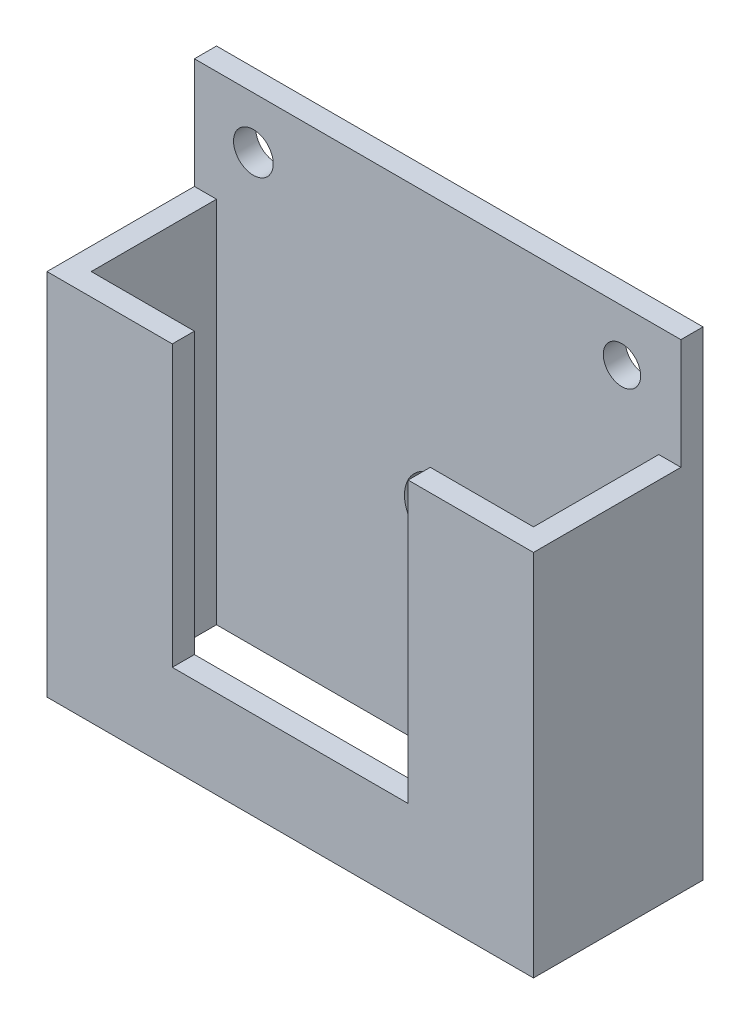
ISO-10303-21;
HEADER;
FILE_DESCRIPTION(('STEP AP214'),'2;1');
FILE_NAME('part.step','',(''),(''),'','','');
FILE_SCHEMA(('AUTOMOTIVE_DESIGN { 1 0 10303 214 1 1 1 1 }'));
ENDSEC;
DATA;
#1=APPLICATION_CONTEXT('core data for automotive mechanical design processes');
#2=APPLICATION_PROTOCOL_DEFINITION('international standard','automotive_design',2000,#1);
#3=PRODUCT_CONTEXT('',#1,'mechanical');
#4=PRODUCT('Part','Part','',(#3));
#5=PRODUCT_RELATED_PRODUCT_CATEGORY('part','',(#4));
#6=PRODUCT_DEFINITION_FORMATION('','',#4);
#7=PRODUCT_DEFINITION_CONTEXT('part definition',#1,'design');
#8=PRODUCT_DEFINITION('design','',#6,#7);
#9=PRODUCT_DEFINITION_SHAPE('','',#8);
#10=(LENGTH_UNIT() NAMED_UNIT(*) SI_UNIT(.MILLI.,.METRE.));
#11=(NAMED_UNIT(*) PLANE_ANGLE_UNIT() SI_UNIT($,.RADIAN.));
#12=(NAMED_UNIT(*) SI_UNIT($,.STERADIAN.) SOLID_ANGLE_UNIT());
#13=UNCERTAINTY_MEASURE_WITH_UNIT(LENGTH_MEASURE(1.E-05),#10,'distance_accuracy_value','');
#14=(GEOMETRIC_REPRESENTATION_CONTEXT(3) GLOBAL_UNCERTAINTY_ASSIGNED_CONTEXT((#13)) GLOBAL_UNIT_ASSIGNED_CONTEXT((#10,
#11,#12)) REPRESENTATION_CONTEXT('',''));
#15=CARTESIAN_POINT('',(0.,0.,0.));
#16=DIRECTION('',(0.,0.,1.));
#17=DIRECTION('',(1.,0.,0.));
#18=AXIS2_PLACEMENT_3D('',#15,#16,#17);
#19=CARTESIAN_POINT('',(-66.,0.,23.));
#20=DIRECTION('',(0.,1.,0.));
#21=DIRECTION('',(0.,0.,1.));
#22=AXIS2_PLACEMENT_3D('',#19,#20,#21);
#23=PLANE('',#22);
#24=DIRECTION('',(0.,0.,1.));
#25=VECTOR('',#24,1.);
#26=CARTESIAN_POINT('',(-66.,0.,23.));
#27=LINE('',#26,#25);
#28=CARTESIAN_POINT('',(-66.,0.,0.));
#29=VERTEX_POINT('',#28);
#30=CARTESIAN_POINT('',(-66.,0.,3.));
#31=VERTEX_POINT('',#30);
#32=EDGE_CURVE('E155',#29,#31,#27,.T.);
#33=ORIENTED_EDGE('',*,*,#32,.T.);
#34=DIRECTION('',(-1.,0.,0.));
#35=VECTOR('',#34,1.);
#36=CARTESIAN_POINT('',(-63.,0.,3.));
#37=LINE('',#36,#35);
#38=CARTESIAN_POINT('',(0.,0.,3.));
#39=VERTEX_POINT('',#38);
#40=EDGE_CURVE('E222',#39,#31,#37,.T.);
#41=ORIENTED_EDGE('',*,*,#40,.F.);
#42=DIRECTION('',(0.,0.,1.));
#43=VECTOR('',#42,1.);
#44=CARTESIAN_POINT('',(0.,0.,23.));
#45=LINE('',#44,#43);
#46=CARTESIAN_POINT('',(0.,0.,0.));
#47=VERTEX_POINT('',#46);
#48=EDGE_CURVE('E167',#47,#39,#45,.T.);
#49=ORIENTED_EDGE('',*,*,#48,.F.);
#50=DIRECTION('',(1.,0.,0.));
#51=VECTOR('',#50,1.);
#52=CARTESIAN_POINT('',(-66.,0.,0.));
#53=LINE('',#52,#51);
#54=EDGE_CURVE('E178',#29,#47,#53,.T.);
#55=ORIENTED_EDGE('',*,*,#54,.F.);
#56=EDGE_LOOP('',(#33,#41,#49,#55));
#57=FACE_BOUND('',#56,.T.);
#58=ADVANCED_FACE('F33',(#57),#23,.T.);
#59=CARTESIAN_POINT('',(-66.,0.,0.));
#60=DIRECTION('',(0.,0.,-1.));
#61=DIRECTION('',(-1.,0.,0.));
#62=AXIS2_PLACEMENT_3D('',#59,#60,#61);
#63=PLANE('',#62);
#64=CARTESIAN_POINT('',(-33.,-37.,0.));
#65=DIRECTION('',(0.,0.,-1.));
#66=DIRECTION('',(-1.,0.,0.));
#67=AXIS2_PLACEMENT_3D('',#64,#65,#66);
#68=CIRCLE('',#67,4.50000000000001);
#69=CARTESIAN_POINT('',(-37.5,-37.,0.));
#70=VERTEX_POINT('',#69);
#71=EDGE_CURVE('E205',#70,#70,#68,.T.);
#72=ORIENTED_EDGE('',*,*,#71,.F.);
#73=EDGE_LOOP('',(#72));
#74=FACE_BOUND('',#73,.T.);
#75=CARTESIAN_POINT('',(-8.,-7.00000000000001,0.));
#76=DIRECTION('',(0.,0.,-1.));
#77=DIRECTION('',(-1.,0.,0.));
#78=AXIS2_PLACEMENT_3D('',#75,#76,#77);
#79=CIRCLE('',#78,2.5305862175137);
#80=CARTESIAN_POINT('',(-10.5305862175137,-7.00000000000001,0.));
#81=VERTEX_POINT('',#80);
#82=EDGE_CURVE('E268',#81,#81,#79,.T.);
#83=ORIENTED_EDGE('',*,*,#82,.F.);
#84=EDGE_LOOP('',(#83));
#85=FACE_BOUND('',#84,.T.);
#86=CARTESIAN_POINT('',(-58.,-7.,0.));
#87=DIRECTION('',(0.,0.,-1.));
#88=DIRECTION('',(-1.,0.,0.));
#89=AXIS2_PLACEMENT_3D('',#86,#87,#88);
#90=CIRCLE('',#89,2.69284221962874);
#91=CARTESIAN_POINT('',(-60.6928422196287,-7.,0.));
#92=VERTEX_POINT('',#91);
#93=EDGE_CURVE('E208',#92,#92,#90,.T.);
#94=ORIENTED_EDGE('',*,*,#93,.F.);
#95=EDGE_LOOP('',(#94));
#96=FACE_BOUND('',#95,.T.);
#97=DIRECTION('',(0.,1.,0.));
#98=VECTOR('',#97,1.);
#99=CARTESIAN_POINT('',(0.,0.,0.));
#100=LINE('',#99,#98);
#101=CARTESIAN_POINT('',(0.,-65.,0.));
#102=VERTEX_POINT('',#101);
#103=EDGE_CURVE('E160',#102,#47,#100,.T.);
#104=ORIENTED_EDGE('',*,*,#103,.F.);
#105=DIRECTION('',(1.,0.,0.));
#106=VECTOR('',#105,1.);
#107=CARTESIAN_POINT('',(-66.,-65.,0.));
#108=LINE('',#107,#106);
#109=CARTESIAN_POINT('',(-66.,-65.,0.));
#110=VERTEX_POINT('',#109);
#111=EDGE_CURVE('E180',#110,#102,#108,.T.);
#112=ORIENTED_EDGE('',*,*,#111,.F.);
#113=DIRECTION('',(0.,1.,0.));
#114=VECTOR('',#113,1.);
#115=CARTESIAN_POINT('',(-66.,0.,0.));
#116=LINE('',#115,#114);
#117=EDGE_CURVE('E157',#110,#29,#116,.T.);
#118=ORIENTED_EDGE('',*,*,#117,.T.);
#119=ORIENTED_EDGE('',*,*,#54,.T.);
#120=EDGE_LOOP('',(#104,#112,#118,#119));
#121=FACE_BOUND('',#120,.T.);
#122=ADVANCED_FACE('F282',(#74,#85,#96,#121),#63,.T.);
#123=CARTESIAN_POINT('',(-66.,-65.,0.));
#124=DIRECTION('',(0.,-1.,0.));
#125=DIRECTION('',(0.,0.,-1.));
#126=AXIS2_PLACEMENT_3D('',#123,#124,#125);
#127=PLANE('',#126);
#128=DIRECTION('',(0.,0.,-1.));
#129=VECTOR('',#128,1.);
#130=CARTESIAN_POINT('',(-3.,-65.,20.));
#131=LINE('',#130,#129);
#132=CARTESIAN_POINT('',(-3.,-65.,20.));
#133=VERTEX_POINT('',#132);
#134=CARTESIAN_POINT('',(-3.,-65.,3.));
#135=VERTEX_POINT('',#134);
#136=EDGE_CURVE('E223',#133,#135,#131,.T.);
#137=ORIENTED_EDGE('',*,*,#136,.T.);
#138=DIRECTION('',(-1.,0.,0.));
#139=VECTOR('',#138,1.);
#140=CARTESIAN_POINT('',(-63.,-65.,3.));
#141=LINE('',#140,#139);
#142=CARTESIAN_POINT('',(-63.,-65.,3.));
#143=VERTEX_POINT('',#142);
#144=EDGE_CURVE('E226',#135,#143,#141,.T.);
#145=ORIENTED_EDGE('',*,*,#144,.T.);
#146=DIRECTION('',(0.,0.,1.));
#147=VECTOR('',#146,1.);
#148=CARTESIAN_POINT('',(-63.,-65.,20.));
#149=LINE('',#148,#147);
#150=CARTESIAN_POINT('',(-63.,-65.,20.));
#151=VERTEX_POINT('',#150);
#152=EDGE_CURVE('E229',#143,#151,#149,.T.);
#153=ORIENTED_EDGE('',*,*,#152,.T.);
#154=DIRECTION('',(1.,0.,0.));
#155=VECTOR('',#154,1.);
#156=CARTESIAN_POINT('',(-63.,-65.,20.));
#157=LINE('',#156,#155);
#158=EDGE_CURVE('E232',#151,#133,#157,.T.);
#159=ORIENTED_EDGE('',*,*,#158,.T.);
#160=EDGE_LOOP('',(#137,#145,#153,#159));
#161=FACE_BOUND('',#160,.T.);
#162=DIRECTION('',(0.,0.,-1.));
#163=VECTOR('',#162,1.);
#164=CARTESIAN_POINT('',(0.,-65.,0.));
#165=LINE('',#164,#163);
#166=CARTESIAN_POINT('',(0.,-65.,23.));
#167=VERTEX_POINT('',#166);
#168=EDGE_CURVE('E173',#167,#102,#165,.T.);
#169=ORIENTED_EDGE('',*,*,#168,.F.);
#170=DIRECTION('',(1.,0.,0.));
#171=VECTOR('',#170,1.);
#172=CARTESIAN_POINT('',(-66.,-65.,23.));
#173=LINE('',#172,#171);
#174=CARTESIAN_POINT('',(-66.,-65.,23.));
#175=VERTEX_POINT('',#174);
#176=EDGE_CURVE('E166',#175,#167,#173,.T.);
#177=ORIENTED_EDGE('',*,*,#176,.F.);
#178=DIRECTION('',(0.,0.,-1.));
#179=VECTOR('',#178,1.);
#180=CARTESIAN_POINT('',(-66.,-65.,0.));
#181=LINE('',#180,#179);
#182=EDGE_CURVE('E154',#175,#110,#181,.T.);
#183=ORIENTED_EDGE('',*,*,#182,.T.);
#184=ORIENTED_EDGE('',*,*,#111,.T.);
#185=EDGE_LOOP('',(#169,#177,#183,#184));
#186=FACE_BOUND('',#185,.T.);
#187=ADVANCED_FACE('F285',(#161,#186),#127,.T.);
#188=CARTESIAN_POINT('',(-66.,-65.,23.));
#189=DIRECTION('',(0.,0.,1.));
#190=DIRECTION('',(1.,0.,0.));
#191=AXIS2_PLACEMENT_3D('',#188,#189,#190);
#192=PLANE('',#191);
#193=DIRECTION('',(1.,0.,0.));
#194=VECTOR('',#193,1.);
#195=CARTESIAN_POINT('',(-66.,-15.,23.));
#196=LINE('',#195,#194);
#197=CARTESIAN_POINT('',(-66.,-15.,23.));
#198=VERTEX_POINT('',#197);
#199=CARTESIAN_POINT('',(-49.,-15.,23.));
#200=VERTEX_POINT('',#199);
#201=EDGE_CURVE('E47',#198,#200,#196,.T.);
#202=ORIENTED_EDGE('',*,*,#201,.F.);
#203=DIRECTION('',(0.,-1.,0.));
#204=VECTOR('',#203,1.);
#205=CARTESIAN_POINT('',(-66.,-65.,23.));
#206=LINE('',#205,#204);
#207=EDGE_CURVE('E144',#198,#175,#206,.T.);
#208=ORIENTED_EDGE('',*,*,#207,.T.);
#209=ORIENTED_EDGE('',*,*,#176,.T.);
#210=DIRECTION('',(0.,-1.,0.));
#211=VECTOR('',#210,1.);
#212=CARTESIAN_POINT('',(0.,-65.,23.));
#213=LINE('',#212,#211);
#214=CARTESIAN_POINT('',(0.,-15.,23.));
#215=VERTEX_POINT('',#214);
#216=EDGE_CURVE('E170',#215,#167,#213,.T.);
#217=ORIENTED_EDGE('',*,*,#216,.F.);
#218=DIRECTION('',(1.,0.,0.));
#219=VECTOR('',#218,1.);
#220=CARTESIAN_POINT('',(-17.,-15.,23.));
#221=LINE('',#220,#219);
#222=CARTESIAN_POINT('',(-17.,-15.,23.));
#223=VERTEX_POINT('',#222);
#224=EDGE_CURVE('E303',#223,#215,#221,.T.);
#225=ORIENTED_EDGE('',*,*,#224,.F.);
#226=DIRECTION('',(0.,1.,0.));
#227=VECTOR('',#226,1.);
#228=CARTESIAN_POINT('',(-17.,0.,23.));
#229=LINE('',#228,#227);
#230=CARTESIAN_POINT('',(-17.,-53.,23.));
#231=VERTEX_POINT('',#230);
#232=EDGE_CURVE('E189',#231,#223,#229,.T.);
#233=ORIENTED_EDGE('',*,*,#232,.F.);
#234=DIRECTION('',(1.,0.,0.));
#235=VECTOR('',#234,1.);
#236=CARTESIAN_POINT('',(-49.,-53.,23.));
#237=LINE('',#236,#235);
#238=CARTESIAN_POINT('',(-49.,-53.,23.));
#239=VERTEX_POINT('',#238);
#240=EDGE_CURVE('E212',#239,#231,#237,.T.);
#241=ORIENTED_EDGE('',*,*,#240,.F.);
#242=DIRECTION('',(0.,-1.,0.));
#243=VECTOR('',#242,1.);
#244=CARTESIAN_POINT('',(-49.,0.,23.));
#245=LINE('',#244,#243);
#246=EDGE_CURVE('E147',#200,#239,#245,.T.);
#247=ORIENTED_EDGE('',*,*,#246,.F.);
#248=EDGE_LOOP('',(#202,#208,#209,#217,#225,#233,#241,#247));
#249=FACE_BOUND('',#248,.T.);
#250=ADVANCED_FACE('F142',(#249),#192,.T.);
#251=CARTESIAN_POINT('',(-66.,0.,0.));
#252=DIRECTION('',(-1.,0.,0.));
#253=DIRECTION('',(0.,0.,1.));
#254=AXIS2_PLACEMENT_3D('',#251,#252,#253);
#255=PLANE('',#254);
#256=DIRECTION('',(0.,-1.,0.));
#257=VECTOR('',#256,1.);
#258=CARTESIAN_POINT('',(-66.,0.,3.));
#259=LINE('',#258,#257);
#260=CARTESIAN_POINT('',(-66.,-15.,3.));
#261=VERTEX_POINT('',#260);
#262=EDGE_CURVE('E138',#31,#261,#259,.T.);
#263=ORIENTED_EDGE('',*,*,#262,.F.);
#264=ORIENTED_EDGE('',*,*,#32,.F.);
#265=ORIENTED_EDGE('',*,*,#117,.F.);
#266=ORIENTED_EDGE('',*,*,#182,.F.);
#267=ORIENTED_EDGE('',*,*,#207,.F.);
#268=DIRECTION('',(0.,0.,1.));
#269=VECTOR('',#268,1.);
#270=CARTESIAN_POINT('',(-66.,-15.,-19.6715680975093));
#271=LINE('',#270,#269);
#272=EDGE_CURVE('E130',#261,#198,#271,.T.);
#273=ORIENTED_EDGE('',*,*,#272,.F.);
#274=EDGE_LOOP('',(#263,#264,#265,#266,#267,#273));
#275=FACE_BOUND('',#274,.T.);
#276=ADVANCED_FACE('F151',(#275),#255,.T.);
#277=CARTESIAN_POINT('',(0.,0.,0.));
#278=DIRECTION('',(-1.,0.,0.));
#279=DIRECTION('',(0.,0.,1.));
#280=AXIS2_PLACEMENT_3D('',#277,#278,#279);
#281=PLANE('',#280);
#282=ORIENTED_EDGE('',*,*,#48,.T.);
#283=DIRECTION('',(0.,1.,0.));
#284=VECTOR('',#283,1.);
#285=CARTESIAN_POINT('',(0.,0.,3.));
#286=LINE('',#285,#284);
#287=CARTESIAN_POINT('',(0.,-15.,3.));
#288=VERTEX_POINT('',#287);
#289=EDGE_CURVE('E148',#288,#39,#286,.T.);
#290=ORIENTED_EDGE('',*,*,#289,.F.);
#291=DIRECTION('',(0.,0.,1.));
#292=VECTOR('',#291,1.);
#293=CARTESIAN_POINT('',(0.,-15.,-19.6715680975093));
#294=LINE('',#293,#292);
#295=EDGE_CURVE('E299',#288,#215,#294,.T.);
#296=ORIENTED_EDGE('',*,*,#295,.T.);
#297=ORIENTED_EDGE('',*,*,#216,.T.);
#298=ORIENTED_EDGE('',*,*,#168,.T.);
#299=ORIENTED_EDGE('',*,*,#103,.T.);
#300=EDGE_LOOP('',(#282,#290,#296,#297,#298,#299));
#301=FACE_BOUND('',#300,.T.);
#302=ADVANCED_FACE('F291',(#301),#281,.F.);
#303=CARTESIAN_POINT('',(-3.,-65.,20.));
#304=DIRECTION('',(1.,0.,0.));
#305=DIRECTION('',(0.,0.,-1.));
#306=AXIS2_PLACEMENT_3D('',#303,#304,#305);
#307=PLANE('',#306);
#308=DIRECTION('',(0.,1.,0.));
#309=VECTOR('',#308,1.);
#310=CARTESIAN_POINT('',(-3.,-65.,20.));
#311=LINE('',#310,#309);
#312=CARTESIAN_POINT('',(-3.,-15.,20.));
#313=VERTEX_POINT('',#312);
#314=EDGE_CURVE('E171',#133,#313,#311,.T.);
#315=ORIENTED_EDGE('',*,*,#314,.T.);
#316=DIRECTION('',(0.,0.,-1.));
#317=VECTOR('',#316,1.);
#318=CARTESIAN_POINT('',(-3.,-15.,20.));
#319=LINE('',#318,#317);
#320=CARTESIAN_POINT('',(-3.,-15.,3.));
#321=VERTEX_POINT('',#320);
#322=EDGE_CURVE('E255',#313,#321,#319,.T.);
#323=ORIENTED_EDGE('',*,*,#322,.T.);
#324=DIRECTION('',(0.,1.,0.));
#325=VECTOR('',#324,1.);
#326=CARTESIAN_POINT('',(-3.,-65.,3.));
#327=LINE('',#326,#325);
#328=EDGE_CURVE('E235',#135,#321,#327,.T.);
#329=ORIENTED_EDGE('',*,*,#328,.F.);
#330=ORIENTED_EDGE('',*,*,#136,.F.);
#331=EDGE_LOOP('',(#315,#323,#329,#330));
#332=FACE_BOUND('',#331,.T.);
#333=ADVANCED_FACE('F254',(#332),#307,.F.);
#334=CARTESIAN_POINT('',(-63.,-65.,20.));
#335=DIRECTION('',(0.,0.,1.));
#336=DIRECTION('',(1.,0.,0.));
#337=AXIS2_PLACEMENT_3D('',#334,#335,#336);
#338=PLANE('',#337);
#339=DIRECTION('',(0.,1.,0.));
#340=VECTOR('',#339,1.);
#341=CARTESIAN_POINT('',(-63.,-65.,20.));
#342=LINE('',#341,#340);
#343=CARTESIAN_POINT('',(-63.,-15.,20.));
#344=VERTEX_POINT('',#343);
#345=EDGE_CURVE('E238',#151,#344,#342,.T.);
#346=ORIENTED_EDGE('',*,*,#345,.T.);
#347=DIRECTION('',(1.,0.,0.));
#348=VECTOR('',#347,1.);
#349=CARTESIAN_POINT('',(-63.,-15.,20.));
#350=LINE('',#349,#348);
#351=CARTESIAN_POINT('',(-49.,-15.,20.));
#352=VERTEX_POINT('',#351);
#353=EDGE_CURVE('E259',#344,#352,#350,.T.);
#354=ORIENTED_EDGE('',*,*,#353,.T.);
#355=DIRECTION('',(0.,1.,0.));
#356=VECTOR('',#355,1.);
#357=CARTESIAN_POINT('',(-49.,0.,20.));
#358=LINE('',#357,#356);
#359=CARTESIAN_POINT('',(-49.,-53.,20.));
#360=VERTEX_POINT('',#359);
#361=EDGE_CURVE('E199',#360,#352,#358,.T.);
#362=ORIENTED_EDGE('',*,*,#361,.F.);
#363=DIRECTION('',(-1.,0.,0.));
#364=VECTOR('',#363,1.);
#365=CARTESIAN_POINT('',(-49.,-53.,20.));
#366=LINE('',#365,#364);
#367=CARTESIAN_POINT('',(-17.,-53.,20.));
#368=VERTEX_POINT('',#367);
#369=EDGE_CURVE('E198',#368,#360,#366,.T.);
#370=ORIENTED_EDGE('',*,*,#369,.F.);
#371=DIRECTION('',(0.,-1.,0.));
#372=VECTOR('',#371,1.);
#373=CARTESIAN_POINT('',(-17.,0.,20.));
#374=LINE('',#373,#372);
#375=CARTESIAN_POINT('',(-17.,-15.,20.));
#376=VERTEX_POINT('',#375);
#377=EDGE_CURVE('E186',#376,#368,#374,.T.);
#378=ORIENTED_EDGE('',*,*,#377,.F.);
#379=DIRECTION('',(1.,0.,0.));
#380=VECTOR('',#379,1.);
#381=CARTESIAN_POINT('',(-63.,-15.,20.));
#382=LINE('',#381,#380);
#383=EDGE_CURVE('E54',#376,#313,#382,.T.);
#384=ORIENTED_EDGE('',*,*,#383,.T.);
#385=ORIENTED_EDGE('',*,*,#314,.F.);
#386=ORIENTED_EDGE('',*,*,#158,.F.);
#387=EDGE_LOOP('',(#346,#354,#362,#370,#378,#384,#385,#386));
#388=FACE_BOUND('',#387,.T.);
#389=ADVANCED_FACE('F194',(#388),#338,.F.);
#390=CARTESIAN_POINT('',(-63.,-65.,20.));
#391=DIRECTION('',(-1.,0.,0.));
#392=DIRECTION('',(0.,0.,1.));
#393=AXIS2_PLACEMENT_3D('',#390,#391,#392);
#394=PLANE('',#393);
#395=DIRECTION('',(0.,1.,0.));
#396=VECTOR('',#395,1.);
#397=CARTESIAN_POINT('',(-63.,-65.,3.));
#398=LINE('',#397,#396);
#399=CARTESIAN_POINT('',(-63.,-15.,3.));
#400=VERTEX_POINT('',#399);
#401=EDGE_CURVE('E240',#143,#400,#398,.T.);
#402=ORIENTED_EDGE('',*,*,#401,.T.);
#403=DIRECTION('',(0.,0.,1.));
#404=VECTOR('',#403,1.);
#405=CARTESIAN_POINT('',(-63.,-15.,20.));
#406=LINE('',#405,#404);
#407=EDGE_CURVE('E256',#400,#344,#406,.T.);
#408=ORIENTED_EDGE('',*,*,#407,.T.);
#409=ORIENTED_EDGE('',*,*,#345,.F.);
#410=ORIENTED_EDGE('',*,*,#152,.F.);
#411=EDGE_LOOP('',(#402,#408,#409,#410));
#412=FACE_BOUND('',#411,.T.);
#413=ADVANCED_FACE('F307',(#412),#394,.F.);
#414=CARTESIAN_POINT('',(-63.,-65.,3.));
#415=DIRECTION('',(0.,0.,-1.));
#416=DIRECTION('',(-1.,0.,0.));
#417=AXIS2_PLACEMENT_3D('',#414,#415,#416);
#418=PLANE('',#417);
#419=ORIENTED_EDGE('',*,*,#40,.T.);
#420=ORIENTED_EDGE('',*,*,#262,.T.);
#421=DIRECTION('',(1.,0.,0.));
#422=VECTOR('',#421,1.);
#423=CARTESIAN_POINT('',(-66.,-15.,3.));
#424=LINE('',#423,#422);
#425=EDGE_CURVE('E133',#261,#400,#424,.T.);
#426=ORIENTED_EDGE('',*,*,#425,.T.);
#427=ORIENTED_EDGE('',*,*,#401,.F.);
#428=ORIENTED_EDGE('',*,*,#144,.F.);
#429=ORIENTED_EDGE('',*,*,#328,.T.);
#430=DIRECTION('',(1.,0.,0.));
#431=VECTOR('',#430,1.);
#432=CARTESIAN_POINT('',(-17.,-15.,3.));
#433=LINE('',#432,#431);
#434=EDGE_CURVE('E248',#321,#288,#433,.T.);
#435=ORIENTED_EDGE('',*,*,#434,.T.);
#436=ORIENTED_EDGE('',*,*,#289,.T.);
#437=EDGE_LOOP('',(#419,#420,#426,#427,#428,#429,#435,#436));
#438=FACE_BOUND('',#437,.T.);
#439=CARTESIAN_POINT('',(-33.,-37.,3.));
#440=DIRECTION('',(0.,0.,-1.));
#441=DIRECTION('',(-1.,0.,0.));
#442=AXIS2_PLACEMENT_3D('',#439,#440,#441);
#443=CIRCLE('',#442,4.50000000000001);
#444=CARTESIAN_POINT('',(-37.5,-37.,3.));
#445=VERTEX_POINT('',#444);
#446=EDGE_CURVE('E200',#445,#445,#443,.F.);
#447=ORIENTED_EDGE('',*,*,#446,.F.);
#448=EDGE_LOOP('',(#447));
#449=FACE_BOUND('',#448,.T.);
#450=CARTESIAN_POINT('',(-8.,-7.00000000000001,3.));
#451=DIRECTION('',(0.,0.,-1.));
#452=DIRECTION('',(-1.,0.,0.));
#453=AXIS2_PLACEMENT_3D('',#450,#451,#452);
#454=CIRCLE('',#453,2.5305862175137);
#455=CARTESIAN_POINT('',(-10.5305862175137,-7.00000000000001,3.));
#456=VERTEX_POINT('',#455);
#457=EDGE_CURVE('E270',#456,#456,#454,.F.);
#458=ORIENTED_EDGE('',*,*,#457,.F.);
#459=EDGE_LOOP('',(#458));
#460=FACE_BOUND('',#459,.T.);
#461=CARTESIAN_POINT('',(-58.,-7.,3.));
#462=DIRECTION('',(0.,0.,-1.));
#463=DIRECTION('',(-1.,0.,0.));
#464=AXIS2_PLACEMENT_3D('',#461,#462,#463);
#465=CIRCLE('',#464,2.69284221962874);
#466=CARTESIAN_POINT('',(-60.6928422196287,-7.,3.));
#467=VERTEX_POINT('',#466);
#468=EDGE_CURVE('E266',#467,#467,#465,.F.);
#469=ORIENTED_EDGE('',*,*,#468,.F.);
#470=EDGE_LOOP('',(#469));
#471=FACE_BOUND('',#470,.T.);
#472=ADVANCED_FACE('F245',(#438,#449,#460,#471),#418,.F.);
#473=CARTESIAN_POINT('',(-49.,0.,-0.001000000000001));
#474=DIRECTION('',(-1.,0.,0.));
#475=DIRECTION('',(0.,-1.,0.));
#476=AXIS2_PLACEMENT_3D('',#473,#474,#475);
#477=PLANE('',#476);
#478=ORIENTED_EDGE('',*,*,#361,.T.);
#479=DIRECTION('',(0.,0.,1.));
#480=VECTOR('',#479,1.);
#481=CARTESIAN_POINT('',(-49.,-15.,-0.001000000000001));
#482=LINE('',#481,#480);
#483=EDGE_CURVE('E11',#352,#200,#482,.T.);
#484=ORIENTED_EDGE('',*,*,#483,.T.);
#485=ORIENTED_EDGE('',*,*,#246,.T.);
#486=DIRECTION('',(0.,0.,1.));
#487=VECTOR('',#486,1.);
#488=CARTESIAN_POINT('',(-49.,-53.,-0.001000000000001));
#489=LINE('',#488,#487);
#490=EDGE_CURVE('E216',#360,#239,#489,.T.);
#491=ORIENTED_EDGE('',*,*,#490,.F.);
#492=EDGE_LOOP('',(#478,#484,#485,#491));
#493=FACE_BOUND('',#492,.T.);
#494=ADVANCED_FACE('F311',(#493),#477,.F.);
#495=CARTESIAN_POINT('',(-17.,0.,-0.001000000000001));
#496=DIRECTION('',(1.,0.,0.));
#497=DIRECTION('',(0.,1.,0.));
#498=AXIS2_PLACEMENT_3D('',#495,#496,#497);
#499=PLANE('',#498);
#500=ORIENTED_EDGE('',*,*,#232,.T.);
#501=DIRECTION('',(0.,0.,-1.));
#502=VECTOR('',#501,1.);
#503=CARTESIAN_POINT('',(-17.,-15.,-0.001000000000001));
#504=LINE('',#503,#502);
#505=EDGE_CURVE('E40',#223,#376,#504,.T.);
#506=ORIENTED_EDGE('',*,*,#505,.T.);
#507=ORIENTED_EDGE('',*,*,#377,.T.);
#508=DIRECTION('',(0.,0.,1.));
#509=VECTOR('',#508,1.);
#510=CARTESIAN_POINT('',(-17.,-53.,-0.001000000000001));
#511=LINE('',#510,#509);
#512=EDGE_CURVE('E217',#368,#231,#511,.T.);
#513=ORIENTED_EDGE('',*,*,#512,.T.);
#514=EDGE_LOOP('',(#500,#506,#507,#513));
#515=FACE_BOUND('',#514,.T.);
#516=ADVANCED_FACE('F185',(#515),#499,.F.);
#517=CARTESIAN_POINT('',(-49.,-53.,-0.001000000000001));
#518=DIRECTION('',(0.,-1.,0.));
#519=DIRECTION('',(0.,0.,-1.));
#520=AXIS2_PLACEMENT_3D('',#517,#518,#519);
#521=PLANE('',#520);
#522=ORIENTED_EDGE('',*,*,#369,.T.);
#523=ORIENTED_EDGE('',*,*,#490,.T.);
#524=ORIENTED_EDGE('',*,*,#240,.T.);
#525=ORIENTED_EDGE('',*,*,#512,.F.);
#526=EDGE_LOOP('',(#522,#523,#524,#525));
#527=FACE_BOUND('',#526,.T.);
#528=ADVANCED_FACE('F313',(#527),#521,.F.);
#529=CARTESIAN_POINT('',(-58.,-7.,23.001));
#530=DIRECTION('',(0.,0.,-1.));
#531=DIRECTION('',(-1.,0.,0.));
#532=AXIS2_PLACEMENT_3D('',#529,#530,#531);
#533=CYLINDRICAL_SURFACE('',#532,2.69284221962874);
#534=ORIENTED_EDGE('',*,*,#93,.T.);
#535=EDGE_LOOP('',(#534));
#536=FACE_BOUND('',#535,.T.);
#537=ORIENTED_EDGE('',*,*,#468,.T.);
#538=EDGE_LOOP('',(#537));
#539=FACE_BOUND('',#538,.T.);
#540=ADVANCED_FACE('F280',(#536,#539),#533,.F.);
#541=CARTESIAN_POINT('',(-8.,-7.00000000000001,23.001));
#542=DIRECTION('',(0.,0.,-1.));
#543=DIRECTION('',(-1.,0.,0.));
#544=AXIS2_PLACEMENT_3D('',#541,#542,#543);
#545=CYLINDRICAL_SURFACE('',#544,2.5305862175137);
#546=ORIENTED_EDGE('',*,*,#82,.T.);
#547=EDGE_LOOP('',(#546));
#548=FACE_BOUND('',#547,.T.);
#549=ORIENTED_EDGE('',*,*,#457,.T.);
#550=EDGE_LOOP('',(#549));
#551=FACE_BOUND('',#550,.T.);
#552=ADVANCED_FACE('F323',(#548,#551),#545,.F.);
#553=CARTESIAN_POINT('',(-33.,-37.,23.001));
#554=DIRECTION('',(0.,0.,-1.));
#555=DIRECTION('',(-1.,0.,0.));
#556=AXIS2_PLACEMENT_3D('',#553,#554,#555);
#557=CYLINDRICAL_SURFACE('',#556,4.50000000000001);
#558=ORIENTED_EDGE('',*,*,#71,.T.);
#559=EDGE_LOOP('',(#558));
#560=FACE_BOUND('',#559,.T.);
#561=ORIENTED_EDGE('',*,*,#446,.T.);
#562=EDGE_LOOP('',(#561));
#563=FACE_BOUND('',#562,.T.);
#564=ADVANCED_FACE('F316',(#560,#563),#557,.F.);
#565=CARTESIAN_POINT('',(-17.,-15.,-19.6715680975093));
#566=DIRECTION('',(0.,-1.,0.));
#567=DIRECTION('',(0.,0.,-1.));
#568=AXIS2_PLACEMENT_3D('',#565,#566,#567);
#569=PLANE('',#568);
#570=ORIENTED_EDGE('',*,*,#383,.F.);
#571=ORIENTED_EDGE('',*,*,#505,.F.);
#572=ORIENTED_EDGE('',*,*,#224,.T.);
#573=ORIENTED_EDGE('',*,*,#295,.F.);
#574=ORIENTED_EDGE('',*,*,#434,.F.);
#575=ORIENTED_EDGE('',*,*,#322,.F.);
#576=EDGE_LOOP('',(#570,#571,#572,#573,#574,#575));
#577=FACE_BOUND('',#576,.T.);
#578=ADVANCED_FACE('F314',(#577),#569,.F.);
#579=CARTESIAN_POINT('',(-66.,-15.,-19.6715680975093));
#580=DIRECTION('',(0.,-1.,0.));
#581=DIRECTION('',(0.,0.,-1.));
#582=AXIS2_PLACEMENT_3D('',#579,#580,#581);
#583=PLANE('',#582);
#584=ORIENTED_EDGE('',*,*,#407,.F.);
#585=ORIENTED_EDGE('',*,*,#425,.F.);
#586=ORIENTED_EDGE('',*,*,#272,.T.);
#587=ORIENTED_EDGE('',*,*,#201,.T.);
#588=ORIENTED_EDGE('',*,*,#483,.F.);
#589=ORIENTED_EDGE('',*,*,#353,.F.);
#590=EDGE_LOOP('',(#584,#585,#586,#587,#588,#589));
#591=FACE_BOUND('',#590,.T.);
#592=ADVANCED_FACE('F131',(#591),#583,.F.);
#593=CLOSED_SHELL('',(#58,#122,#187,#250,#276,#302,#333,#389,#413,#472,#494,#516,#528,#540,#552,
#564,#578,#592));
#594=MANIFOLD_SOLID_BREP('B2',#593);
#595=ADVANCED_BREP_SHAPE_REPRESENTATION('',(#18,#594),#14);
#596=SHAPE_DEFINITION_REPRESENTATION(#9,#595);
ENDSEC;
END-ISO-10303-21;
